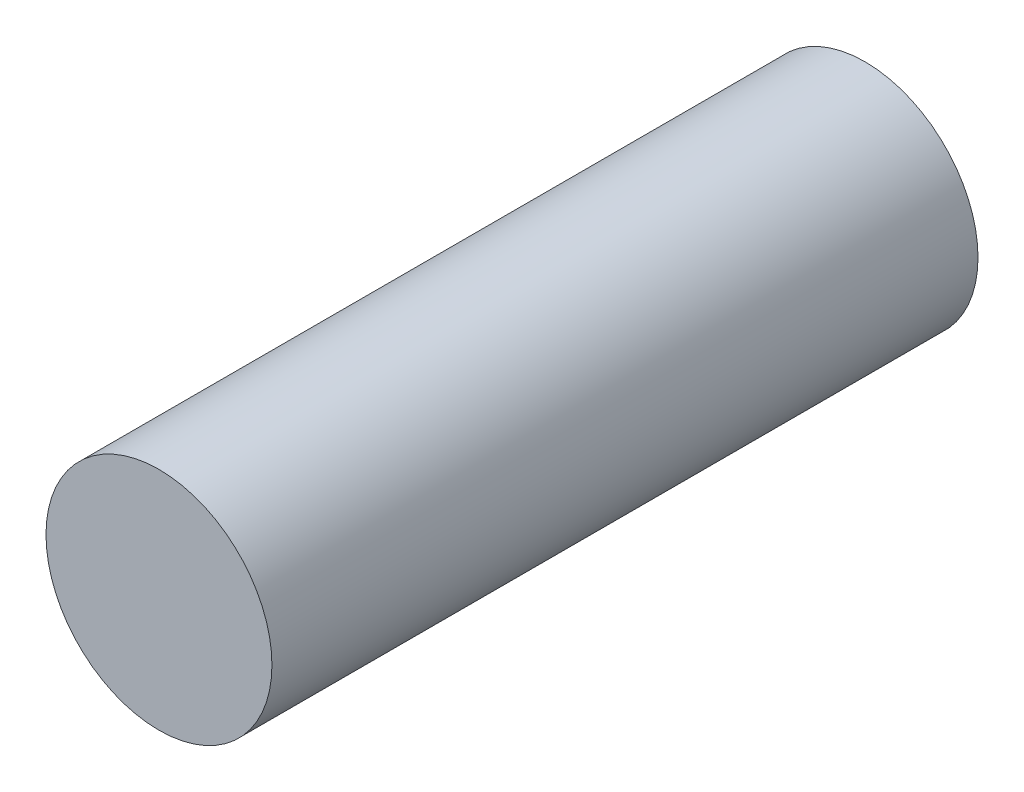
ISO-10303-21;
HEADER;
FILE_DESCRIPTION(('STEP AP214'),'2;1');
FILE_NAME('part.step','',(''),(''),'','','');
FILE_SCHEMA(('AUTOMOTIVE_DESIGN { 1 0 10303 214 1 1 1 1 }'));
ENDSEC;
DATA;
#1=APPLICATION_CONTEXT('core data for automotive mechanical design processes');
#2=APPLICATION_PROTOCOL_DEFINITION('international standard','automotive_design',2000,#1);
#3=PRODUCT_CONTEXT('',#1,'mechanical');
#4=PRODUCT('Part','Part','',(#3));
#5=PRODUCT_RELATED_PRODUCT_CATEGORY('part','',(#4));
#6=PRODUCT_DEFINITION_FORMATION('','',#4);
#7=PRODUCT_DEFINITION_CONTEXT('part definition',#1,'design');
#8=PRODUCT_DEFINITION('design','',#6,#7);
#9=PRODUCT_DEFINITION_SHAPE('','',#8);
#10=(LENGTH_UNIT() NAMED_UNIT(*) SI_UNIT(.MILLI.,.METRE.));
#11=(NAMED_UNIT(*) PLANE_ANGLE_UNIT() SI_UNIT($,.RADIAN.));
#12=(NAMED_UNIT(*) SI_UNIT($,.STERADIAN.) SOLID_ANGLE_UNIT());
#13=UNCERTAINTY_MEASURE_WITH_UNIT(LENGTH_MEASURE(1.E-05),#10,'distance_accuracy_value','');
#14=(GEOMETRIC_REPRESENTATION_CONTEXT(3) GLOBAL_UNCERTAINTY_ASSIGNED_CONTEXT((#13)) GLOBAL_UNIT_ASSIGNED_CONTEXT((#10,
#11,#12)) REPRESENTATION_CONTEXT('',''));
#15=CARTESIAN_POINT('',(0.,0.,0.));
#16=DIRECTION('',(0.,0.,1.));
#17=DIRECTION('',(1.,0.,0.));
#18=AXIS2_PLACEMENT_3D('',#15,#16,#17);
#19=CARTESIAN_POINT('',(0.3999992,0.,2.50000008));
#20=DIRECTION('',(0.,0.,-1.));
#21=DIRECTION('',(0.,-1.,0.));
#22=AXIS2_PLACEMENT_3D('',#19,#20,#21);
#23=PLANE('',#22);
#24=CARTESIAN_POINT('',(0.,0.,2.50000008));
#25=DIRECTION('',(0.,0.,1.));
#26=DIRECTION('',(1.,0.,0.));
#27=AXIS2_PLACEMENT_3D('',#24,#25,#26);
#28=CIRCLE('',#27,0.3999992);
#29=CARTESIAN_POINT('',(-0.3999992,0.,2.50000008));
#30=VERTEX_POINT('',#29);
#31=EDGE_CURVE('E11',#30,#30,#28,.T.);
#32=ORIENTED_EDGE('',*,*,#31,.T.);
#33=EDGE_LOOP('',(#32));
#34=FACE_BOUND('',#33,.T.);
#35=ADVANCED_FACE('F17',(#34),#23,.F.);
#36=CARTESIAN_POINT('',(0.3999992,0.,0.));
#37=DIRECTION('',(0.,0.,-1.));
#38=DIRECTION('',(0.,-1.,0.));
#39=AXIS2_PLACEMENT_3D('',#36,#37,#38);
#40=PLANE('',#39);
#41=CARTESIAN_POINT('',(0.,0.,0.));
#42=DIRECTION('',(0.,0.,1.));
#43=DIRECTION('',(1.,0.,0.));
#44=AXIS2_PLACEMENT_3D('',#41,#42,#43);
#45=CIRCLE('',#44,0.3999992);
#46=CARTESIAN_POINT('',(-0.3999992,0.,0.));
#47=VERTEX_POINT('',#46);
#48=EDGE_CURVE('E21',#47,#47,#45,.T.);
#49=ORIENTED_EDGE('',*,*,#48,.F.);
#50=EDGE_LOOP('',(#49));
#51=FACE_BOUND('',#50,.T.);
#52=ADVANCED_FACE('F19',(#51),#40,.T.);
#53=CARTESIAN_POINT('',(0.,0.,0.));
#54=DIRECTION('',(0.,0.,-1.));
#55=DIRECTION('',(1.,0.,0.));
#56=AXIS2_PLACEMENT_3D('',#53,#54,#55);
#57=CYLINDRICAL_SURFACE('',#56,0.3999992);
#58=ORIENTED_EDGE('',*,*,#48,.T.);
#59=DIRECTION('',(0.,0.,1.));
#60=VECTOR('',#59,1.);
#61=CARTESIAN_POINT('',(-0.3999992,0.,0.));
#62=LINE('',#61,#60);
#63=EDGE_CURVE('E27',#47,#30,#62,.T.);
#64=ORIENTED_EDGE('',*,*,#63,.T.);
#65=ORIENTED_EDGE('',*,*,#31,.F.);
#66=ORIENTED_EDGE('',*,*,#63,.F.);
#67=EDGE_LOOP('',(#58,#64,#65,#66));
#68=FACE_BOUND('',#67,.T.);
#69=ADVANCED_FACE('F42',(#68),#57,.T.);
#70=CLOSED_SHELL('',(#35,#52,#69));
#71=MANIFOLD_SOLID_BREP('B1',#70);
#72=ADVANCED_BREP_SHAPE_REPRESENTATION('',(#18,#71),#14);
#73=SHAPE_DEFINITION_REPRESENTATION(#9,#72);
ENDSEC;
END-ISO-10303-21;
